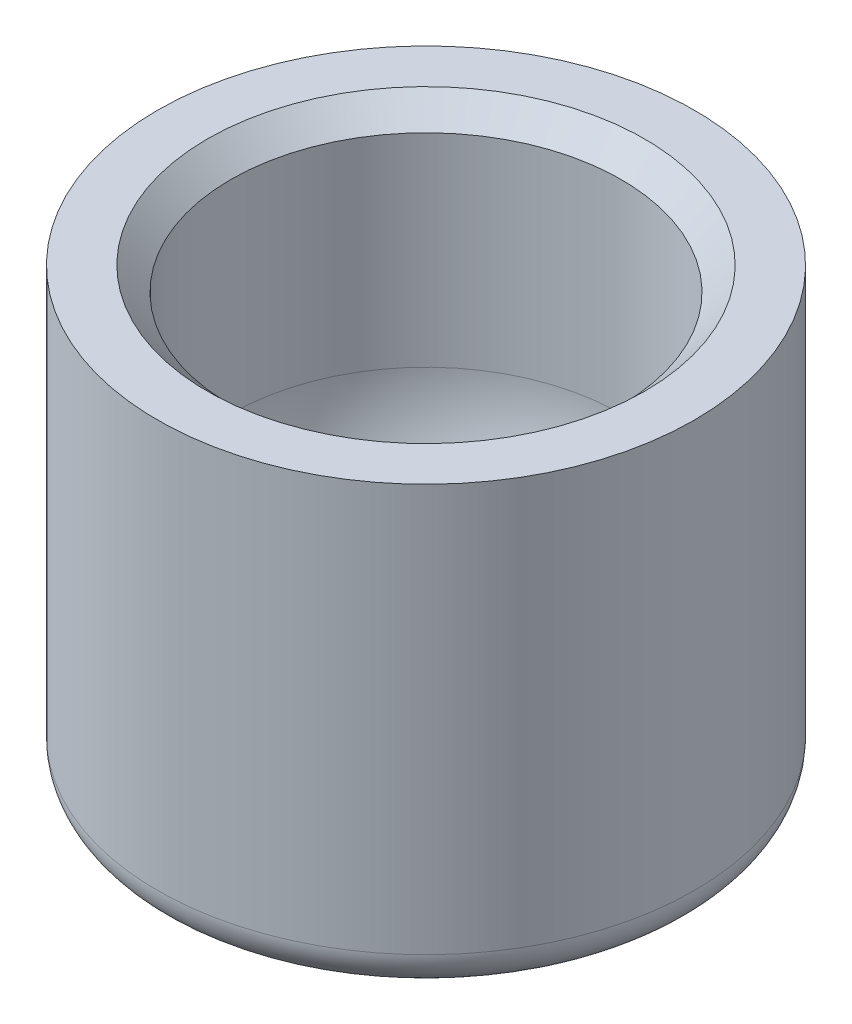
ISO-10303-21;
HEADER;
FILE_DESCRIPTION(('STEP AP214'),'2;1');
FILE_NAME('part.step','',(''),(''),'','','');
FILE_SCHEMA(('AUTOMOTIVE_DESIGN { 1 0 10303 214 1 1 1 1 }'));
ENDSEC;
DATA;
#1=APPLICATION_CONTEXT('core data for automotive mechanical design processes');
#2=APPLICATION_PROTOCOL_DEFINITION('international standard','automotive_design',2000,#1);
#3=PRODUCT_CONTEXT('',#1,'mechanical');
#4=PRODUCT('Part','Part','',(#3));
#5=PRODUCT_RELATED_PRODUCT_CATEGORY('part','',(#4));
#6=PRODUCT_DEFINITION_FORMATION('','',#4);
#7=PRODUCT_DEFINITION_CONTEXT('part definition',#1,'design');
#8=PRODUCT_DEFINITION('design','',#6,#7);
#9=PRODUCT_DEFINITION_SHAPE('','',#8);
#10=(LENGTH_UNIT() NAMED_UNIT(*) SI_UNIT(.MILLI.,.METRE.));
#11=(NAMED_UNIT(*) PLANE_ANGLE_UNIT() SI_UNIT($,.RADIAN.));
#12=(NAMED_UNIT(*) SI_UNIT($,.STERADIAN.) SOLID_ANGLE_UNIT());
#13=UNCERTAINTY_MEASURE_WITH_UNIT(LENGTH_MEASURE(1.E-05),#10,'distance_accuracy_value','');
#14=(GEOMETRIC_REPRESENTATION_CONTEXT(3) GLOBAL_UNCERTAINTY_ASSIGNED_CONTEXT((#13)) GLOBAL_UNIT_ASSIGNED_CONTEXT((#10,
#11,#12)) REPRESENTATION_CONTEXT('',''));
#15=CARTESIAN_POINT('',(0.,0.,0.));
#16=DIRECTION('',(0.,0.,1.));
#17=DIRECTION('',(1.,0.,0.));
#18=AXIS2_PLACEMENT_3D('',#15,#16,#17);
#19=CARTESIAN_POINT('',(0.,-13.716,0.));
#20=DIRECTION('',(0.,1.,0.));
#21=DIRECTION('',(-1.,0.,0.));
#22=AXIS2_PLACEMENT_3D('',#19,#20,#21);
#23=CYLINDRICAL_SURFACE('',#22,6.35);
#24=CARTESIAN_POINT('',(0.,-0.762000000000002,0.));
#25=DIRECTION('',(0.,-1.,0.));
#26=DIRECTION('',(1.,0.,0.));
#27=AXIS2_PLACEMENT_3D('',#24,#25,#26);
#28=CIRCLE('',#27,6.35);
#29=CARTESIAN_POINT('',(6.35,-0.762000000000002,0.));
#30=VERTEX_POINT('',#29);
#31=EDGE_CURVE('E39',#30,#30,#28,.F.);
#32=ORIENTED_EDGE('',*,*,#31,.T.);
#33=EDGE_LOOP('',(#32));
#34=FACE_BOUND('',#33,.T.);
#35=CARTESIAN_POINT('',(0.,-7.366,0.));
#36=DIRECTION('',(0.,1.,0.));
#37=DIRECTION('',(-1.,0.,0.));
#38=AXIS2_PLACEMENT_3D('',#35,#36,#37);
#39=CIRCLE('',#38,6.35);
#40=CARTESIAN_POINT('',(-6.35,-7.366,0.));
#41=VERTEX_POINT('',#40);
#42=EDGE_CURVE('E58',#41,#41,#39,.T.);
#43=ORIENTED_EDGE('',*,*,#42,.F.);
#44=EDGE_LOOP('',(#43));
#45=FACE_BOUND('',#44,.T.);
#46=ADVANCED_FACE('F32',(#34,#45),#23,.F.);
#47=CARTESIAN_POINT('',(6.35,0.,0.));
#48=DIRECTION('',(0.,-1.,0.));
#49=DIRECTION('',(1.,0.,0.));
#50=AXIS2_PLACEMENT_3D('',#47,#48,#49);
#51=PLANE('',#50);
#52=CARTESIAN_POINT('',(0.,0.,0.));
#53=DIRECTION('',(0.,-1.,0.));
#54=DIRECTION('',(1.,0.,0.));
#55=AXIS2_PLACEMENT_3D('',#52,#53,#54);
#56=CIRCLE('',#55,7.11200000000001);
#57=CARTESIAN_POINT('',(7.11200000000001,0.,0.));
#58=VERTEX_POINT('',#57);
#59=EDGE_CURVE('E10',#58,#58,#56,.T.);
#60=ORIENTED_EDGE('',*,*,#59,.T.);
#61=EDGE_LOOP('',(#60));
#62=FACE_BOUND('',#61,.T.);
#63=CARTESIAN_POINT('',(0.,0.,0.));
#64=DIRECTION('',(0.,1.,0.));
#65=DIRECTION('',(-1.,0.,0.));
#66=AXIS2_PLACEMENT_3D('',#63,#64,#65);
#67=CIRCLE('',#66,8.73125);
#68=CARTESIAN_POINT('',(-8.73125,0.,0.));
#69=VERTEX_POINT('',#68);
#70=EDGE_CURVE('E43',#69,#69,#67,.T.);
#71=ORIENTED_EDGE('',*,*,#70,.T.);
#72=EDGE_LOOP('',(#71));
#73=FACE_BOUND('',#72,.T.);
#74=ADVANCED_FACE('F65',(#62,#73),#51,.F.);
#75=CARTESIAN_POINT('',(0.,-13.716,0.));
#76=DIRECTION('',(0.,1.,0.));
#77=DIRECTION('',(-1.,0.,0.));
#78=AXIS2_PLACEMENT_3D('',#75,#76,#77);
#79=CYLINDRICAL_SURFACE('',#78,8.73125);
#80=ORIENTED_EDGE('',*,*,#70,.F.);
#81=EDGE_LOOP('',(#80));
#82=FACE_BOUND('',#81,.T.);
#83=CARTESIAN_POINT('',(0.,-13.2543508195075,0.));
#84=DIRECTION('',(0.,1.,0.));
#85=DIRECTION('',(-1.,0.,0.));
#86=AXIS2_PLACEMENT_3D('',#83,#84,#85);
#87=CIRCLE('',#86,8.73125);
#88=CARTESIAN_POINT('',(-8.73125,-13.2543508195075,0.));
#89=VERTEX_POINT('',#88);
#90=EDGE_CURVE('E47',#89,#89,#87,.T.);
#91=ORIENTED_EDGE('',*,*,#90,.T.);
#92=EDGE_LOOP('',(#91));
#93=FACE_BOUND('',#92,.T.);
#94=ADVANCED_FACE('F69',(#82,#93),#79,.T.);
#95=CARTESIAN_POINT('',(0.,-13.2543508195075,0.));
#96=DIRECTION('',(0.,1.,0.));
#97=DIRECTION('',(-1.,0.,0.));
#98=AXIS2_PLACEMENT_3D('',#95,#96,#97);
#99=TOROIDAL_SURFACE('',#98,7.46125,1.27);
#100=ORIENTED_EDGE('',*,*,#90,.F.);
#101=EDGE_LOOP('',(#100));
#102=FACE_BOUND('',#101,.T.);
#103=CARTESIAN_POINT('',(0.,-14.3406956364011,0.));
#104=DIRECTION('',(0.,1.,0.));
#105=DIRECTION('',(-1.,0.,0.));
#106=AXIS2_PLACEMENT_3D('',#103,#104,#105);
#107=CIRCLE('',#106,8.1190911197306);
#108=CARTESIAN_POINT('',(-8.1190911197306,-14.3406956364011,0.));
#109=VERTEX_POINT('',#108);
#110=EDGE_CURVE('E52',#109,#109,#107,.T.);
#111=ORIENTED_EDGE('',*,*,#110,.T.);
#112=EDGE_LOOP('',(#111));
#113=FACE_BOUND('',#112,.T.);
#114=ADVANCED_FACE('F74',(#102,#113),#99,.T.);
#115=CARTESIAN_POINT('',(0.,-18.8727215694265,0.));
#116=DIRECTION('',(0.,1.,0.));
#117=DIRECTION('',(-1.,0.,0.));
#118=AXIS2_PLACEMENT_3D('',#115,#116,#117);
#119=CONICAL_SURFACE('',#118,0.635,1.02630255604817);
#120=ORIENTED_EDGE('',*,*,#110,.F.);
#121=EDGE_LOOP('',(#120));
#122=FACE_BOUND('',#121,.T.);
#123=CARTESIAN_POINT('',(0.,-18.8727215694265,0.));
#124=DIRECTION('',(0.,1.,0.));
#125=DIRECTION('',(-1.,0.,0.));
#126=AXIS2_PLACEMENT_3D('',#123,#124,#125);
#127=CIRCLE('',#126,0.635);
#128=CARTESIAN_POINT('',(-0.635,-18.8727215694265,0.));
#129=VERTEX_POINT('',#128);
#130=EDGE_CURVE('E55',#129,#129,#127,.T.);
#131=ORIENTED_EDGE('',*,*,#130,.T.);
#132=EDGE_LOOP('',(#131));
#133=FACE_BOUND('',#132,.T.);
#134=ADVANCED_FACE('F78',(#122,#133),#119,.T.);
#135=CARTESIAN_POINT('',(0.,-17.8240960912716,0.));
#136=DIRECTION('',(0.,1.,0.));
#137=DIRECTION('',(1.,0.,0.));
#138=AXIS2_PLACEMENT_3D('',#135,#136,#137);
#139=SPHERICAL_SURFACE('',#138,1.22590390872838);
#140=ORIENTED_EDGE('',*,*,#130,.F.);
#141=EDGE_LOOP('',(#140));
#142=FACE_BOUND('',#141,.T.);
#143=ADVANCED_FACE('F82',(#142),#139,.T.);
#144=CARTESIAN_POINT('',(0.,-7.366,0.));
#145=DIRECTION('',(0.,1.,0.));
#146=DIRECTION('',(1.,0.,0.));
#147=AXIS2_PLACEMENT_3D('',#144,#145,#146);
#148=SPHERICAL_SURFACE('',#147,6.35);
#149=ORIENTED_EDGE('',*,*,#42,.T.);
#150=EDGE_LOOP('',(#149));
#151=FACE_BOUND('',#150,.T.);
#152=ADVANCED_FACE('F62',(#151),#148,.F.);
#153=CARTESIAN_POINT('',(0.,-0.762000000000002,0.));
#154=DIRECTION('',(0.,1.,0.));
#155=DIRECTION('',(-1.,0.,0.));
#156=AXIS2_PLACEMENT_3D('',#153,#154,#155);
#157=CONICAL_SURFACE('',#156,6.35,0.785398163397451);
#158=ORIENTED_EDGE('',*,*,#59,.F.);
#159=EDGE_LOOP('',(#158));
#160=FACE_BOUND('',#159,.T.);
#161=ORIENTED_EDGE('',*,*,#31,.F.);
#162=EDGE_LOOP('',(#161));
#163=FACE_BOUND('',#162,.T.);
#164=ADVANCED_FACE('F34',(#160,#163),#157,.F.);
#165=CLOSED_SHELL('',(#46,#74,#94,#114,#134,#143,#152,#164));
#166=MANIFOLD_SOLID_BREP('B2',#165);
#167=ADVANCED_BREP_SHAPE_REPRESENTATION('',(#18,#166),#14);
#168=SHAPE_DEFINITION_REPRESENTATION(#9,#167);
ENDSEC;
END-ISO-10303-21;
